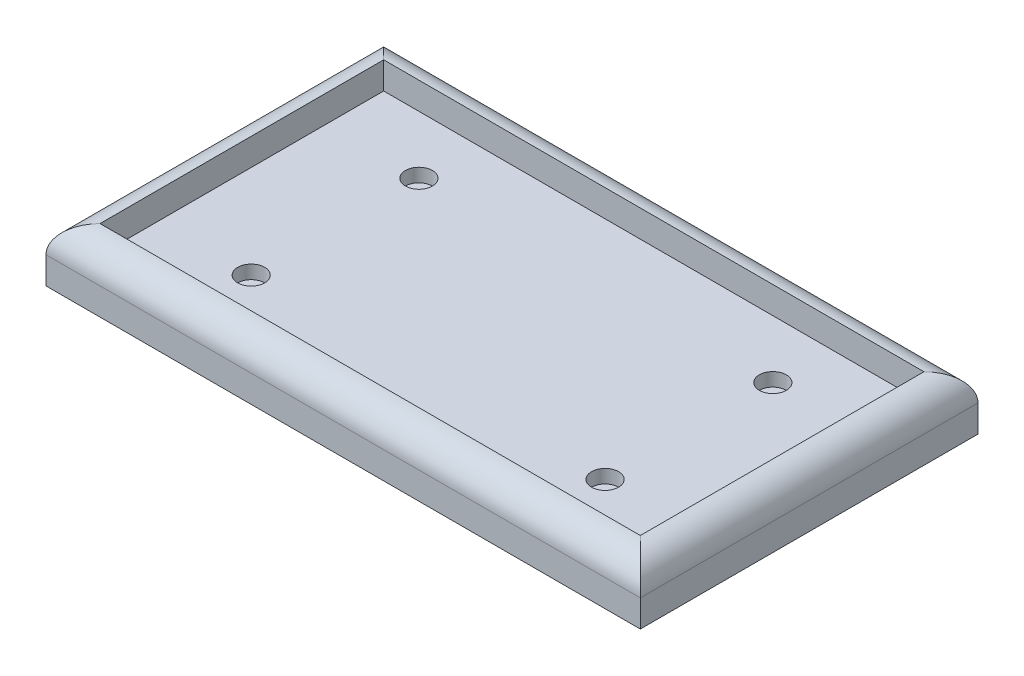
ISO-10303-21;
HEADER;
FILE_DESCRIPTION(('STEP AP214'),'2;1');
FILE_NAME('part.step','',(''),(''),'','','');
FILE_SCHEMA(('AUTOMOTIVE_DESIGN { 1 0 10303 214 1 1 1 1 }'));
ENDSEC;
DATA;
#1=APPLICATION_CONTEXT('core data for automotive mechanical design processes');
#2=APPLICATION_PROTOCOL_DEFINITION('international standard','automotive_design',2000,#1);
#3=PRODUCT_CONTEXT('',#1,'mechanical');
#4=PRODUCT('Part','Part','',(#3));
#5=PRODUCT_RELATED_PRODUCT_CATEGORY('part','',(#4));
#6=PRODUCT_DEFINITION_FORMATION('','',#4);
#7=PRODUCT_DEFINITION_CONTEXT('part definition',#1,'design');
#8=PRODUCT_DEFINITION('design','',#6,#7);
#9=PRODUCT_DEFINITION_SHAPE('','',#8);
#10=(LENGTH_UNIT() NAMED_UNIT(*) SI_UNIT(.MILLI.,.METRE.));
#11=(NAMED_UNIT(*) PLANE_ANGLE_UNIT() SI_UNIT($,.RADIAN.));
#12=(NAMED_UNIT(*) SI_UNIT($,.STERADIAN.) SOLID_ANGLE_UNIT());
#13=UNCERTAINTY_MEASURE_WITH_UNIT(LENGTH_MEASURE(1.E-05),#10,'distance_accuracy_value','');
#14=(GEOMETRIC_REPRESENTATION_CONTEXT(3) GLOBAL_UNCERTAINTY_ASSIGNED_CONTEXT((#13)) GLOBAL_UNIT_ASSIGNED_CONTEXT((#10,
#11,#12)) REPRESENTATION_CONTEXT('',''));
#15=CARTESIAN_POINT('',(0.,0.,0.));
#16=DIRECTION('',(0.,0.,1.));
#17=DIRECTION('',(1.,0.,0.));
#18=AXIS2_PLACEMENT_3D('',#15,#16,#17);
#19=CARTESIAN_POINT('',(-65.5,20.,31.045));
#20=DIRECTION('',(0.,-1.,0.));
#21=DIRECTION('',(0.,0.,-1.));
#22=AXIS2_PLACEMENT_3D('',#19,#20,#21);
#23=CYLINDRICAL_SURFACE('',#22,2.);
#24=CARTESIAN_POINT('',(-65.5,-5.,31.045));
#25=DIRECTION('',(0.,-1.,0.));
#26=DIRECTION('',(0.,0.,-1.));
#27=AXIS2_PLACEMENT_3D('',#24,#25,#26);
#28=CIRCLE('',#27,2.);
#29=CARTESIAN_POINT('',(-65.5,-5.,29.045));
#30=VERTEX_POINT('',#29);
#31=EDGE_CURVE('E243',#30,#30,#28,.T.);
#32=ORIENTED_EDGE('',*,*,#31,.T.);
#33=EDGE_LOOP('',(#32));
#34=FACE_BOUND('',#33,.T.);
#35=CARTESIAN_POINT('',(-65.5,5.,31.045));
#36=DIRECTION('',(0.,1.,0.));
#37=DIRECTION('',(0.,0.,1.));
#38=AXIS2_PLACEMENT_3D('',#35,#36,#37);
#39=CIRCLE('',#38,2.);
#40=CARTESIAN_POINT('',(-65.5,5.,33.045));
#41=VERTEX_POINT('',#40);
#42=EDGE_CURVE('E39',#41,#41,#39,.F.);
#43=ORIENTED_EDGE('',*,*,#42,.F.);
#44=EDGE_LOOP('',(#43));
#45=FACE_BOUND('',#44,.T.);
#46=ADVANCED_FACE('F35',(#34,#45),#23,.F.);
#47=CARTESIAN_POINT('',(-65.5,20.,-31.045));
#48=DIRECTION('',(0.,-1.,0.));
#49=DIRECTION('',(0.,0.,-1.));
#50=AXIS2_PLACEMENT_3D('',#47,#48,#49);
#51=CYLINDRICAL_SURFACE('',#50,2.);
#52=CARTESIAN_POINT('',(-65.5,-5.,-31.045));
#53=DIRECTION('',(0.,-1.,0.));
#54=DIRECTION('',(0.,0.,-1.));
#55=AXIS2_PLACEMENT_3D('',#52,#53,#54);
#56=CIRCLE('',#55,2.);
#57=CARTESIAN_POINT('',(-65.5,-5.,-33.045));
#58=VERTEX_POINT('',#57);
#59=EDGE_CURVE('E239',#58,#58,#56,.T.);
#60=ORIENTED_EDGE('',*,*,#59,.T.);
#61=EDGE_LOOP('',(#60));
#62=FACE_BOUND('',#61,.T.);
#63=CARTESIAN_POINT('',(-65.5,5.,-31.045));
#64=DIRECTION('',(0.,1.,0.));
#65=DIRECTION('',(0.,0.,1.));
#66=AXIS2_PLACEMENT_3D('',#63,#64,#65);
#67=CIRCLE('',#66,2.);
#68=CARTESIAN_POINT('',(-65.5,5.,-29.045));
#69=VERTEX_POINT('',#68);
#70=EDGE_CURVE('E225',#69,#69,#67,.F.);
#71=ORIENTED_EDGE('',*,*,#70,.F.);
#72=EDGE_LOOP('',(#71));
#73=FACE_BOUND('',#72,.T.);
#74=ADVANCED_FACE('F327',(#62,#73),#51,.F.);
#75=CARTESIAN_POINT('',(65.5,20.,-31.045));
#76=DIRECTION('',(0.,-1.,0.));
#77=DIRECTION('',(0.,0.,-1.));
#78=AXIS2_PLACEMENT_3D('',#75,#76,#77);
#79=CYLINDRICAL_SURFACE('',#78,2.);
#80=CARTESIAN_POINT('',(65.5,-5.,-31.045));
#81=DIRECTION('',(0.,-1.,0.));
#82=DIRECTION('',(0.,0.,-1.));
#83=AXIS2_PLACEMENT_3D('',#80,#81,#82);
#84=CIRCLE('',#83,2.);
#85=CARTESIAN_POINT('',(65.5,-5.,-33.045));
#86=VERTEX_POINT('',#85);
#87=EDGE_CURVE('E234',#86,#86,#84,.T.);
#88=ORIENTED_EDGE('',*,*,#87,.T.);
#89=EDGE_LOOP('',(#88));
#90=FACE_BOUND('',#89,.T.);
#91=CARTESIAN_POINT('',(65.5,5.,-31.045));
#92=DIRECTION('',(0.,1.,0.));
#93=DIRECTION('',(0.,0.,1.));
#94=AXIS2_PLACEMENT_3D('',#91,#92,#93);
#95=CIRCLE('',#94,2.);
#96=CARTESIAN_POINT('',(65.5,5.,-29.045));
#97=VERTEX_POINT('',#96);
#98=EDGE_CURVE('E222',#97,#97,#95,.F.);
#99=ORIENTED_EDGE('',*,*,#98,.F.);
#100=EDGE_LOOP('',(#99));
#101=FACE_BOUND('',#100,.T.);
#102=ADVANCED_FACE('F333',(#90,#101),#79,.F.);
#103=CARTESIAN_POINT('',(65.5,20.,31.045));
#104=DIRECTION('',(0.,-1.,0.));
#105=DIRECTION('',(0.,0.,-1.));
#106=AXIS2_PLACEMENT_3D('',#103,#104,#105);
#107=CYLINDRICAL_SURFACE('',#106,2.);
#108=CARTESIAN_POINT('',(65.5,-5.,31.045));
#109=DIRECTION('',(0.,-1.,0.));
#110=DIRECTION('',(0.,0.,-1.));
#111=AXIS2_PLACEMENT_3D('',#108,#109,#110);
#112=CIRCLE('',#111,2.);
#113=CARTESIAN_POINT('',(65.5,-5.,29.045));
#114=VERTEX_POINT('',#113);
#115=EDGE_CURVE('E230',#114,#114,#112,.T.);
#116=ORIENTED_EDGE('',*,*,#115,.T.);
#117=EDGE_LOOP('',(#116));
#118=FACE_BOUND('',#117,.T.);
#119=CARTESIAN_POINT('',(65.5,5.,31.045));
#120=DIRECTION('',(0.,1.,0.));
#121=DIRECTION('',(0.,0.,1.));
#122=AXIS2_PLACEMENT_3D('',#119,#120,#121);
#123=CIRCLE('',#122,2.);
#124=CARTESIAN_POINT('',(65.5,5.,33.045));
#125=VERTEX_POINT('',#124);
#126=EDGE_CURVE('E219',#125,#125,#123,.F.);
#127=ORIENTED_EDGE('',*,*,#126,.F.);
#128=EDGE_LOOP('',(#127));
#129=FACE_BOUND('',#128,.T.);
#130=ADVANCED_FACE('F339',(#118,#129),#107,.F.);
#131=CARTESIAN_POINT('',(-110.,20.,-62.5));
#132=DIRECTION('',(1.,0.,0.));
#133=DIRECTION('',(0.,0.,-1.));
#134=AXIS2_PLACEMENT_3D('',#131,#132,#133);
#135=PLANE('',#134);
#136=DIRECTION('',(0.,-1.,0.));
#137=VECTOR('',#136,1.);
#138=CARTESIAN_POINT('',(-110.,20.,62.5));
#139=LINE('',#138,#137);
#140=CARTESIAN_POINT('',(-110.,10.,62.5));
#141=VERTEX_POINT('',#140);
#142=CARTESIAN_POINT('',(-110.,0.,62.5));
#143=VERTEX_POINT('',#142);
#144=EDGE_CURVE('E205',#141,#143,#139,.T.);
#145=ORIENTED_EDGE('',*,*,#144,.F.);
#146=DIRECTION('',(0.,0.,1.));
#147=VECTOR('',#146,1.);
#148=CARTESIAN_POINT('',(-110.,10.,-62.5));
#149=LINE('',#148,#147);
#150=CARTESIAN_POINT('',(-110.,10.,-62.5));
#151=VERTEX_POINT('',#150);
#152=EDGE_CURVE('E11',#141,#151,#149,.F.);
#153=ORIENTED_EDGE('',*,*,#152,.T.);
#154=DIRECTION('',(0.,-1.,0.));
#155=VECTOR('',#154,1.);
#156=CARTESIAN_POINT('',(-110.,20.,-62.5));
#157=LINE('',#156,#155);
#158=CARTESIAN_POINT('',(-110.,0.,-62.5));
#159=VERTEX_POINT('',#158);
#160=EDGE_CURVE('E199',#151,#159,#157,.T.);
#161=ORIENTED_EDGE('',*,*,#160,.T.);
#162=DIRECTION('',(0.,0.,1.));
#163=VECTOR('',#162,1.);
#164=CARTESIAN_POINT('',(-110.,0.,-62.5));
#165=LINE('',#164,#163);
#166=EDGE_CURVE('E180',#159,#143,#165,.T.);
#167=ORIENTED_EDGE('',*,*,#166,.T.);
#168=EDGE_LOOP('',(#145,#153,#161,#167));
#169=FACE_BOUND('',#168,.T.);
#170=ADVANCED_FACE('F273',(#169),#135,.F.);
#171=CARTESIAN_POINT('',(110.,20.,62.5));
#172=DIRECTION('',(0.,0.,-1.));
#173=DIRECTION('',(-1.,0.,0.));
#174=AXIS2_PLACEMENT_3D('',#171,#172,#173);
#175=PLANE('',#174);
#176=DIRECTION('',(0.,-1.,0.));
#177=VECTOR('',#176,1.);
#178=CARTESIAN_POINT('',(110.,20.,62.5));
#179=LINE('',#178,#177);
#180=CARTESIAN_POINT('',(110.,10.,62.5));
#181=VERTEX_POINT('',#180);
#182=CARTESIAN_POINT('',(110.,0.,62.5));
#183=VERTEX_POINT('',#182);
#184=EDGE_CURVE('E203',#181,#183,#179,.T.);
#185=ORIENTED_EDGE('',*,*,#184,.F.);
#186=DIRECTION('',(1.,0.,0.));
#187=VECTOR('',#186,1.);
#188=CARTESIAN_POINT('',(110.,10.,62.5));
#189=LINE('',#188,#187);
#190=EDGE_CURVE('E210',#181,#141,#189,.F.);
#191=ORIENTED_EDGE('',*,*,#190,.T.);
#192=ORIENTED_EDGE('',*,*,#144,.T.);
#193=DIRECTION('',(1.,0.,0.));
#194=VECTOR('',#193,1.);
#195=CARTESIAN_POINT('',(110.,0.,62.5));
#196=LINE('',#195,#194);
#197=EDGE_CURVE('E190',#143,#183,#196,.T.);
#198=ORIENTED_EDGE('',*,*,#197,.T.);
#199=EDGE_LOOP('',(#185,#191,#192,#198));
#200=FACE_BOUND('',#199,.T.);
#201=ADVANCED_FACE('F285',(#200),#175,.F.);
#202=CARTESIAN_POINT('',(110.,20.,-62.5));
#203=DIRECTION('',(-1.,0.,0.));
#204=DIRECTION('',(0.,0.,1.));
#205=AXIS2_PLACEMENT_3D('',#202,#203,#204);
#206=PLANE('',#205);
#207=DIRECTION('',(0.,-1.,0.));
#208=VECTOR('',#207,1.);
#209=CARTESIAN_POINT('',(110.,20.,-62.5));
#210=LINE('',#209,#208);
#211=CARTESIAN_POINT('',(110.,10.,-62.5));
#212=VERTEX_POINT('',#211);
#213=CARTESIAN_POINT('',(110.,0.,-62.5));
#214=VERTEX_POINT('',#213);
#215=EDGE_CURVE('E201',#212,#214,#210,.T.);
#216=ORIENTED_EDGE('',*,*,#215,.F.);
#217=DIRECTION('',(0.,0.,-1.));
#218=VECTOR('',#217,1.);
#219=CARTESIAN_POINT('',(110.,10.,-62.5));
#220=LINE('',#219,#218);
#221=EDGE_CURVE('E207',#212,#181,#220,.F.);
#222=ORIENTED_EDGE('',*,*,#221,.T.);
#223=ORIENTED_EDGE('',*,*,#184,.T.);
#224=DIRECTION('',(0.,0.,-1.));
#225=VECTOR('',#224,1.);
#226=CARTESIAN_POINT('',(110.,0.,-62.5));
#227=LINE('',#226,#225);
#228=EDGE_CURVE('E193',#183,#214,#227,.T.);
#229=ORIENTED_EDGE('',*,*,#228,.T.);
#230=EDGE_LOOP('',(#216,#222,#223,#229));
#231=FACE_BOUND('',#230,.T.);
#232=ADVANCED_FACE('F282',(#231),#206,.F.);
#233=CARTESIAN_POINT('',(110.,20.,-62.5));
#234=DIRECTION('',(0.,0.,1.));
#235=DIRECTION('',(1.,0.,0.));
#236=AXIS2_PLACEMENT_3D('',#233,#234,#235);
#237=PLANE('',#236);
#238=ORIENTED_EDGE('',*,*,#160,.F.);
#239=DIRECTION('',(-1.,0.,0.));
#240=VECTOR('',#239,1.);
#241=CARTESIAN_POINT('',(110.,10.,-62.5));
#242=LINE('',#241,#240);
#243=EDGE_CURVE('E44',#151,#212,#242,.F.);
#244=ORIENTED_EDGE('',*,*,#243,.T.);
#245=ORIENTED_EDGE('',*,*,#215,.T.);
#246=DIRECTION('',(-1.,0.,0.));
#247=VECTOR('',#246,1.);
#248=CARTESIAN_POINT('',(110.,0.,-62.5));
#249=LINE('',#248,#247);
#250=EDGE_CURVE('E196',#214,#159,#249,.T.);
#251=ORIENTED_EDGE('',*,*,#250,.T.);
#252=EDGE_LOOP('',(#238,#244,#245,#251));
#253=FACE_BOUND('',#252,.T.);
#254=ADVANCED_FACE('F265',(#253),#237,.F.);
#255=CARTESIAN_POINT('',(0.,0.,0.));
#256=DIRECTION('',(0.,-1.,0.));
#257=DIRECTION('',(0.,0.,-1.));
#258=AXIS2_PLACEMENT_3D('',#255,#256,#257);
#259=PLANE('',#258);
#260=DIRECTION('',(0.,0.,-1.));
#261=VECTOR('',#260,1.);
#262=CARTESIAN_POINT('',(-85.5,0.,51.045));
#263=LINE('',#262,#261);
#264=CARTESIAN_POINT('',(-85.5,0.,51.045));
#265=VERTEX_POINT('',#264);
#266=CARTESIAN_POINT('',(-85.5,0.,-51.045));
#267=VERTEX_POINT('',#266);
#268=EDGE_CURVE('E52',#265,#267,#263,.T.);
#269=ORIENTED_EDGE('',*,*,#268,.F.);
#270=DIRECTION('',(-1.,0.,0.));
#271=VECTOR('',#270,1.);
#272=CARTESIAN_POINT('',(85.5,0.,51.045));
#273=LINE('',#272,#271);
#274=CARTESIAN_POINT('',(85.5,0.,51.045));
#275=VERTEX_POINT('',#274);
#276=EDGE_CURVE('E56',#275,#265,#273,.T.);
#277=ORIENTED_EDGE('',*,*,#276,.F.);
#278=DIRECTION('',(0.,0.,1.));
#279=VECTOR('',#278,1.);
#280=CARTESIAN_POINT('',(85.5,0.,51.045));
#281=LINE('',#280,#279);
#282=CARTESIAN_POINT('',(85.5,0.,-51.045));
#283=VERTEX_POINT('',#282);
#284=EDGE_CURVE('E252',#283,#275,#281,.T.);
#285=ORIENTED_EDGE('',*,*,#284,.F.);
#286=DIRECTION('',(1.,0.,0.));
#287=VECTOR('',#286,1.);
#288=CARTESIAN_POINT('',(85.5,0.,-51.045));
#289=LINE('',#288,#287);
#290=EDGE_CURVE('E250',#267,#283,#289,.T.);
#291=ORIENTED_EDGE('',*,*,#290,.F.);
#292=EDGE_LOOP('',(#269,#277,#285,#291));
#293=FACE_BOUND('',#292,.T.);
#294=ORIENTED_EDGE('',*,*,#166,.F.);
#295=ORIENTED_EDGE('',*,*,#250,.F.);
#296=ORIENTED_EDGE('',*,*,#228,.F.);
#297=ORIENTED_EDGE('',*,*,#197,.F.);
#298=EDGE_LOOP('',(#294,#295,#296,#297));
#299=FACE_BOUND('',#298,.T.);
#300=ADVANCED_FACE('F261',(#293,#299),#259,.T.);
#301=CARTESIAN_POINT('',(-100.,10.,-52.5));
#302=DIRECTION('',(-1.,0.,0.));
#303=DIRECTION('',(0.,0.,1.));
#304=AXIS2_PLACEMENT_3D('',#301,#302,#303);
#305=PLANE('',#304);
#306=DIRECTION('',(0.,0.,1.));
#307=VECTOR('',#306,1.);
#308=CARTESIAN_POINT('',(-100.,20.,-52.5));
#309=LINE('',#308,#307);
#310=CARTESIAN_POINT('',(-100.,20.,-52.5));
#311=VERTEX_POINT('',#310);
#312=CARTESIAN_POINT('',(-100.,20.,52.5));
#313=VERTEX_POINT('',#312);
#314=EDGE_CURVE('E167',#311,#313,#309,.T.);
#315=ORIENTED_EDGE('',*,*,#314,.T.);
#316=DIRECTION('',(0.,1.,0.));
#317=VECTOR('',#316,1.);
#318=CARTESIAN_POINT('',(-100.,10.,52.5));
#319=LINE('',#318,#317);
#320=CARTESIAN_POINT('',(-100.,10.,52.5));
#321=VERTEX_POINT('',#320);
#322=EDGE_CURVE('E166',#321,#313,#319,.T.);
#323=ORIENTED_EDGE('',*,*,#322,.F.);
#324=DIRECTION('',(0.,0.,1.));
#325=VECTOR('',#324,1.);
#326=CARTESIAN_POINT('',(-100.,10.,-52.5));
#327=LINE('',#326,#325);
#328=CARTESIAN_POINT('',(-100.,10.,-52.5));
#329=VERTEX_POINT('',#328);
#330=EDGE_CURVE('E153',#329,#321,#327,.T.);
#331=ORIENTED_EDGE('',*,*,#330,.F.);
#332=DIRECTION('',(0.,1.,0.));
#333=VECTOR('',#332,1.);
#334=CARTESIAN_POINT('',(-100.,10.,-52.5));
#335=LINE('',#334,#333);
#336=EDGE_CURVE('E178',#329,#311,#335,.T.);
#337=ORIENTED_EDGE('',*,*,#336,.T.);
#338=EDGE_LOOP('',(#315,#323,#331,#337));
#339=FACE_BOUND('',#338,.T.);
#340=ADVANCED_FACE('F264',(#339),#305,.F.);
#341=CARTESIAN_POINT('',(100.,10.,-52.5));
#342=DIRECTION('',(0.,0.,-1.));
#343=DIRECTION('',(-1.,0.,0.));
#344=AXIS2_PLACEMENT_3D('',#341,#342,#343);
#345=PLANE('',#344);
#346=DIRECTION('',(-1.,0.,0.));
#347=VECTOR('',#346,1.);
#348=CARTESIAN_POINT('',(100.,20.,-52.5));
#349=LINE('',#348,#347);
#350=CARTESIAN_POINT('',(100.,20.,-52.5));
#351=VERTEX_POINT('',#350);
#352=EDGE_CURVE('E157',#351,#311,#349,.T.);
#353=ORIENTED_EDGE('',*,*,#352,.T.);
#354=ORIENTED_EDGE('',*,*,#336,.F.);
#355=DIRECTION('',(-1.,0.,0.));
#356=VECTOR('',#355,1.);
#357=CARTESIAN_POINT('',(100.,10.,-52.5));
#358=LINE('',#357,#356);
#359=CARTESIAN_POINT('',(100.,10.,-52.5));
#360=VERTEX_POINT('',#359);
#361=EDGE_CURVE('E163',#360,#329,#358,.T.);
#362=ORIENTED_EDGE('',*,*,#361,.F.);
#363=DIRECTION('',(0.,1.,0.));
#364=VECTOR('',#363,1.);
#365=CARTESIAN_POINT('',(100.,10.,-52.5));
#366=LINE('',#365,#364);
#367=EDGE_CURVE('E181',#360,#351,#366,.T.);
#368=ORIENTED_EDGE('',*,*,#367,.T.);
#369=EDGE_LOOP('',(#353,#354,#362,#368));
#370=FACE_BOUND('',#369,.T.);
#371=ADVANCED_FACE('F311',(#370),#345,.F.);
#372=CARTESIAN_POINT('',(100.,10.,-52.5));
#373=DIRECTION('',(1.,0.,0.));
#374=DIRECTION('',(0.,0.,-1.));
#375=AXIS2_PLACEMENT_3D('',#372,#373,#374);
#376=PLANE('',#375);
#377=DIRECTION('',(0.,0.,-1.));
#378=VECTOR('',#377,1.);
#379=CARTESIAN_POINT('',(100.,20.,-52.5));
#380=LINE('',#379,#378);
#381=CARTESIAN_POINT('',(100.,20.,52.5));
#382=VERTEX_POINT('',#381);
#383=EDGE_CURVE('E173',#382,#351,#380,.T.);
#384=ORIENTED_EDGE('',*,*,#383,.T.);
#385=ORIENTED_EDGE('',*,*,#367,.F.);
#386=DIRECTION('',(0.,0.,-1.));
#387=VECTOR('',#386,1.);
#388=CARTESIAN_POINT('',(100.,10.,-52.5));
#389=LINE('',#388,#387);
#390=CARTESIAN_POINT('',(100.,10.,52.5));
#391=VERTEX_POINT('',#390);
#392=EDGE_CURVE('E160',#391,#360,#389,.T.);
#393=ORIENTED_EDGE('',*,*,#392,.F.);
#394=DIRECTION('',(0.,1.,0.));
#395=VECTOR('',#394,1.);
#396=CARTESIAN_POINT('',(100.,10.,52.5));
#397=LINE('',#396,#395);
#398=EDGE_CURVE('E184',#391,#382,#397,.T.);
#399=ORIENTED_EDGE('',*,*,#398,.T.);
#400=EDGE_LOOP('',(#384,#385,#393,#399));
#401=FACE_BOUND('',#400,.T.);
#402=ADVANCED_FACE('F302',(#401),#376,.F.);
#403=CARTESIAN_POINT('',(100.,10.,52.5));
#404=DIRECTION('',(0.,0.,1.));
#405=DIRECTION('',(1.,0.,0.));
#406=AXIS2_PLACEMENT_3D('',#403,#404,#405);
#407=PLANE('',#406);
#408=DIRECTION('',(1.,0.,0.));
#409=VECTOR('',#408,1.);
#410=CARTESIAN_POINT('',(100.,20.,52.5));
#411=LINE('',#410,#409);
#412=EDGE_CURVE('E169',#313,#382,#411,.T.);
#413=ORIENTED_EDGE('',*,*,#412,.T.);
#414=ORIENTED_EDGE('',*,*,#398,.F.);
#415=DIRECTION('',(1.,0.,0.));
#416=VECTOR('',#415,1.);
#417=CARTESIAN_POINT('',(100.,10.,52.5));
#418=LINE('',#417,#416);
#419=EDGE_CURVE('E156',#321,#391,#418,.T.);
#420=ORIENTED_EDGE('',*,*,#419,.F.);
#421=ORIENTED_EDGE('',*,*,#322,.T.);
#422=EDGE_LOOP('',(#413,#414,#420,#421));
#423=FACE_BOUND('',#422,.T.);
#424=ADVANCED_FACE('F306',(#423),#407,.F.);
#425=CARTESIAN_POINT('',(0.,10.,0.));
#426=DIRECTION('',(0.,-1.,0.));
#427=DIRECTION('',(0.,0.,-1.));
#428=AXIS2_PLACEMENT_3D('',#425,#426,#427);
#429=PLANE('',#428);
#430=CARTESIAN_POINT('',(65.5,10.,-31.045));
#431=DIRECTION('',(0.,1.,0.));
#432=DIRECTION('',(0.,0.,1.));
#433=AXIS2_PLACEMENT_3D('',#430,#431,#432);
#434=CIRCLE('',#433,5.00000000000001);
#435=CARTESIAN_POINT('',(65.5,10.,-26.045));
#436=VERTEX_POINT('',#435);
#437=EDGE_CURVE('E548',#436,#436,#434,.T.);
#438=ORIENTED_EDGE('',*,*,#437,.F.);
#439=EDGE_LOOP('',(#438));
#440=FACE_BOUND('',#439,.T.);
#441=CARTESIAN_POINT('',(65.5,10.,31.045));
#442=DIRECTION('',(0.,1.,0.));
#443=DIRECTION('',(0.,0.,1.));
#444=AXIS2_PLACEMENT_3D('',#441,#442,#443);
#445=CIRCLE('',#444,5.);
#446=CARTESIAN_POINT('',(65.5,10.,36.045));
#447=VERTEX_POINT('',#446);
#448=EDGE_CURVE('E540',#447,#447,#445,.T.);
#449=ORIENTED_EDGE('',*,*,#448,.F.);
#450=EDGE_LOOP('',(#449));
#451=FACE_BOUND('',#450,.T.);
#452=CARTESIAN_POINT('',(-65.5,10.,31.045));
#453=DIRECTION('',(0.,1.,0.));
#454=DIRECTION('',(0.,0.,1.));
#455=AXIS2_PLACEMENT_3D('',#452,#453,#454);
#456=CIRCLE('',#455,5.);
#457=CARTESIAN_POINT('',(-65.5,10.,36.045));
#458=VERTEX_POINT('',#457);
#459=EDGE_CURVE('E533',#458,#458,#456,.T.);
#460=ORIENTED_EDGE('',*,*,#459,.F.);
#461=EDGE_LOOP('',(#460));
#462=FACE_BOUND('',#461,.T.);
#463=CARTESIAN_POINT('',(-65.5,10.,-31.045));
#464=DIRECTION('',(0.,1.,0.));
#465=DIRECTION('',(0.,0.,1.));
#466=AXIS2_PLACEMENT_3D('',#463,#464,#465);
#467=CIRCLE('',#466,5.);
#468=CARTESIAN_POINT('',(-65.5,10.,-26.045));
#469=VERTEX_POINT('',#468);
#470=EDGE_CURVE('E537',#469,#469,#467,.T.);
#471=ORIENTED_EDGE('',*,*,#470,.F.);
#472=EDGE_LOOP('',(#471));
#473=FACE_BOUND('',#472,.T.);
#474=ORIENTED_EDGE('',*,*,#330,.T.);
#475=ORIENTED_EDGE('',*,*,#419,.T.);
#476=ORIENTED_EDGE('',*,*,#392,.T.);
#477=ORIENTED_EDGE('',*,*,#361,.T.);
#478=EDGE_LOOP('',(#474,#475,#476,#477));
#479=FACE_BOUND('',#478,.T.);
#480=ADVANCED_FACE('F313',(#440,#451,#462,#473,#479),#429,.F.);
#481=CARTESIAN_POINT('',(-100.,10.,0.));
#482=DIRECTION('',(0.,0.,1.));
#483=DIRECTION('',(1.,0.,0.));
#484=AXIS2_PLACEMENT_3D('',#481,#482,#483);
#485=CYLINDRICAL_SURFACE('',#484,10.);
#486=CARTESIAN_POINT('',(-100.,10.,-52.5));
#487=DIRECTION('',(-0.707106781186547,0.,0.707106781186548));
#488=DIRECTION('',(0.707106781186548,0.,0.707106781186547));
#489=AXIS2_PLACEMENT_3D('',#486,#487,#488);
#490=ELLIPSE('',#489,14.1421356237309,10.);
#491=EDGE_CURVE('E214',#151,#311,#490,.F.);
#492=ORIENTED_EDGE('',*,*,#491,.F.);
#493=ORIENTED_EDGE('',*,*,#152,.F.);
#494=CARTESIAN_POINT('',(-100.,10.,52.5));
#495=DIRECTION('',(0.707106781186548,0.,0.707106781186547));
#496=DIRECTION('',(-0.707106781186547,0.,0.707106781186548));
#497=AXIS2_PLACEMENT_3D('',#494,#495,#496);
#498=ELLIPSE('',#497,14.1421356237309,10.);
#499=EDGE_CURVE('E170',#313,#141,#498,.T.);
#500=ORIENTED_EDGE('',*,*,#499,.F.);
#501=ORIENTED_EDGE('',*,*,#314,.F.);
#502=EDGE_LOOP('',(#492,#493,#500,#501));
#503=FACE_BOUND('',#502,.T.);
#504=ADVANCED_FACE('F37',(#503),#485,.T.);
#505=CARTESIAN_POINT('',(0.,10.,52.5));
#506=DIRECTION('',(1.,0.,0.));
#507=DIRECTION('',(0.,0.,-1.));
#508=AXIS2_PLACEMENT_3D('',#505,#506,#507);
#509=CYLINDRICAL_SURFACE('',#508,10.);
#510=ORIENTED_EDGE('',*,*,#499,.T.);
#511=ORIENTED_EDGE('',*,*,#190,.F.);
#512=CARTESIAN_POINT('',(100.,10.,52.5));
#513=DIRECTION('',(0.707106781186547,0.,-0.707106781186548));
#514=DIRECTION('',(0.707106781186548,0.,0.707106781186547));
#515=AXIS2_PLACEMENT_3D('',#512,#513,#514);
#516=ELLIPSE('',#515,14.1421356237309,10.);
#517=EDGE_CURVE('E147',#382,#181,#516,.T.);
#518=ORIENTED_EDGE('',*,*,#517,.F.);
#519=ORIENTED_EDGE('',*,*,#412,.F.);
#520=EDGE_LOOP('',(#510,#511,#518,#519));
#521=FACE_BOUND('',#520,.T.);
#522=ADVANCED_FACE('F289',(#521),#509,.T.);
#523=CARTESIAN_POINT('',(0.,10.,-52.5));
#524=DIRECTION('',(-1.,0.,0.));
#525=DIRECTION('',(0.,0.,1.));
#526=AXIS2_PLACEMENT_3D('',#523,#524,#525);
#527=CYLINDRICAL_SURFACE('',#526,10.);
#528=ORIENTED_EDGE('',*,*,#491,.T.);
#529=ORIENTED_EDGE('',*,*,#352,.F.);
#530=CARTESIAN_POINT('',(100.,10.,-52.5));
#531=DIRECTION('',(-0.707106781186548,0.,-0.707106781186547));
#532=DIRECTION('',(-0.707106781186547,0.,0.707106781186548));
#533=AXIS2_PLACEMENT_3D('',#530,#531,#532);
#534=ELLIPSE('',#533,14.142135623731,10.);
#535=EDGE_CURVE('E145',#212,#351,#534,.F.);
#536=ORIENTED_EDGE('',*,*,#535,.F.);
#537=ORIENTED_EDGE('',*,*,#243,.F.);
#538=EDGE_LOOP('',(#528,#529,#536,#537));
#539=FACE_BOUND('',#538,.T.);
#540=ADVANCED_FACE('F298',(#539),#527,.T.);
#541=CARTESIAN_POINT('',(100.,10.,0.));
#542=DIRECTION('',(0.,0.,-1.));
#543=DIRECTION('',(-1.,0.,0.));
#544=AXIS2_PLACEMENT_3D('',#541,#542,#543);
#545=CYLINDRICAL_SURFACE('',#544,10.);
#546=ORIENTED_EDGE('',*,*,#517,.T.);
#547=ORIENTED_EDGE('',*,*,#221,.F.);
#548=ORIENTED_EDGE('',*,*,#535,.T.);
#549=ORIENTED_EDGE('',*,*,#383,.F.);
#550=EDGE_LOOP('',(#546,#547,#548,#549));
#551=FACE_BOUND('',#550,.T.);
#552=ADVANCED_FACE('F300',(#551),#545,.T.);
#553=CARTESIAN_POINT('',(-85.5,-5.,51.045));
#554=DIRECTION('',(1.,0.,0.));
#555=DIRECTION('',(0.,0.,-1.));
#556=AXIS2_PLACEMENT_3D('',#553,#554,#555);
#557=PLANE('',#556);
#558=ORIENTED_EDGE('',*,*,#268,.T.);
#559=DIRECTION('',(0.,1.,0.));
#560=VECTOR('',#559,1.);
#561=CARTESIAN_POINT('',(-85.5,-5.,-51.045));
#562=LINE('',#561,#560);
#563=CARTESIAN_POINT('',(-85.5,-5.,-51.045));
#564=VERTEX_POINT('',#563);
#565=EDGE_CURVE('E128',#564,#267,#562,.T.);
#566=ORIENTED_EDGE('',*,*,#565,.F.);
#567=DIRECTION('',(0.,0.,-1.));
#568=VECTOR('',#567,1.);
#569=CARTESIAN_POINT('',(-85.5,-5.,51.045));
#570=LINE('',#569,#568);
#571=CARTESIAN_POINT('',(-85.5,-5.,51.045));
#572=VERTEX_POINT('',#571);
#573=EDGE_CURVE('E134',#572,#564,#570,.T.);
#574=ORIENTED_EDGE('',*,*,#573,.F.);
#575=DIRECTION('',(0.,1.,0.));
#576=VECTOR('',#575,1.);
#577=CARTESIAN_POINT('',(-85.5,-5.,51.045));
#578=LINE('',#577,#576);
#579=EDGE_CURVE('E248',#572,#265,#578,.T.);
#580=ORIENTED_EDGE('',*,*,#579,.T.);
#581=EDGE_LOOP('',(#558,#566,#574,#580));
#582=FACE_BOUND('',#581,.T.);
#583=ADVANCED_FACE('F144',(#582),#557,.F.);
#584=CARTESIAN_POINT('',(85.5,-5.,-51.045));
#585=DIRECTION('',(0.,0.,1.));
#586=DIRECTION('',(1.,0.,0.));
#587=AXIS2_PLACEMENT_3D('',#584,#585,#586);
#588=PLANE('',#587);
#589=ORIENTED_EDGE('',*,*,#290,.T.);
#590=DIRECTION('',(0.,1.,0.));
#591=VECTOR('',#590,1.);
#592=CARTESIAN_POINT('',(85.5,-5.,-51.045));
#593=LINE('',#592,#591);
#594=CARTESIAN_POINT('',(85.5,-5.,-51.045));
#595=VERTEX_POINT('',#594);
#596=EDGE_CURVE('E130',#595,#283,#593,.T.);
#597=ORIENTED_EDGE('',*,*,#596,.F.);
#598=DIRECTION('',(1.,0.,0.));
#599=VECTOR('',#598,1.);
#600=CARTESIAN_POINT('',(85.5,-5.,-51.045));
#601=LINE('',#600,#599);
#602=EDGE_CURVE('E123',#564,#595,#601,.T.);
#603=ORIENTED_EDGE('',*,*,#602,.F.);
#604=ORIENTED_EDGE('',*,*,#565,.T.);
#605=EDGE_LOOP('',(#589,#597,#603,#604));
#606=FACE_BOUND('',#605,.T.);
#607=ADVANCED_FACE('F126',(#606),#588,.F.);
#608=CARTESIAN_POINT('',(85.5,-5.,51.045));
#609=DIRECTION('',(-1.,0.,0.));
#610=DIRECTION('',(0.,0.,1.));
#611=AXIS2_PLACEMENT_3D('',#608,#609,#610);
#612=PLANE('',#611);
#613=ORIENTED_EDGE('',*,*,#284,.T.);
#614=DIRECTION('',(0.,1.,0.));
#615=VECTOR('',#614,1.);
#616=CARTESIAN_POINT('',(85.5,-5.,51.045));
#617=LINE('',#616,#615);
#618=CARTESIAN_POINT('',(85.5,-5.,51.045));
#619=VERTEX_POINT('',#618);
#620=EDGE_CURVE('E149',#619,#275,#617,.T.);
#621=ORIENTED_EDGE('',*,*,#620,.F.);
#622=DIRECTION('',(0.,0.,1.));
#623=VECTOR('',#622,1.);
#624=CARTESIAN_POINT('',(85.5,-5.,51.045));
#625=LINE('',#624,#623);
#626=EDGE_CURVE('E133',#595,#619,#625,.T.);
#627=ORIENTED_EDGE('',*,*,#626,.F.);
#628=ORIENTED_EDGE('',*,*,#596,.T.);
#629=EDGE_LOOP('',(#613,#621,#627,#628));
#630=FACE_BOUND('',#629,.T.);
#631=ADVANCED_FACE('F260',(#630),#612,.F.);
#632=CARTESIAN_POINT('',(85.5,-5.,51.045));
#633=DIRECTION('',(0.,0.,-1.));
#634=DIRECTION('',(-1.,0.,0.));
#635=AXIS2_PLACEMENT_3D('',#632,#633,#634);
#636=PLANE('',#635);
#637=ORIENTED_EDGE('',*,*,#276,.T.);
#638=ORIENTED_EDGE('',*,*,#579,.F.);
#639=DIRECTION('',(-1.,0.,0.));
#640=VECTOR('',#639,1.);
#641=CARTESIAN_POINT('',(85.5,-5.,51.045));
#642=LINE('',#641,#640);
#643=EDGE_CURVE('E139',#619,#572,#642,.T.);
#644=ORIENTED_EDGE('',*,*,#643,.F.);
#645=ORIENTED_EDGE('',*,*,#620,.T.);
#646=EDGE_LOOP('',(#637,#638,#644,#645));
#647=FACE_BOUND('',#646,.T.);
#648=ADVANCED_FACE('F258',(#647),#636,.F.);
#649=CARTESIAN_POINT('',(0.,-5.,0.));
#650=DIRECTION('',(0.,1.,0.));
#651=DIRECTION('',(0.,0.,1.));
#652=AXIS2_PLACEMENT_3D('',#649,#650,#651);
#653=PLANE('',#652);
#654=ORIENTED_EDGE('',*,*,#115,.F.);
#655=EDGE_LOOP('',(#654));
#656=FACE_BOUND('',#655,.T.);
#657=ORIENTED_EDGE('',*,*,#87,.F.);
#658=EDGE_LOOP('',(#657));
#659=FACE_BOUND('',#658,.T.);
#660=ORIENTED_EDGE('',*,*,#59,.F.);
#661=EDGE_LOOP('',(#660));
#662=FACE_BOUND('',#661,.T.);
#663=ORIENTED_EDGE('',*,*,#31,.F.);
#664=EDGE_LOOP('',(#663));
#665=FACE_BOUND('',#664,.T.);
#666=ORIENTED_EDGE('',*,*,#573,.T.);
#667=ORIENTED_EDGE('',*,*,#602,.T.);
#668=ORIENTED_EDGE('',*,*,#626,.T.);
#669=ORIENTED_EDGE('',*,*,#643,.T.);
#670=EDGE_LOOP('',(#666,#667,#668,#669));
#671=FACE_BOUND('',#670,.T.);
#672=ADVANCED_FACE('F137',(#656,#659,#662,#665,#671),#653,.F.);
#673=CARTESIAN_POINT('',(65.5,5.,31.045));
#674=DIRECTION('',(0.,1.,0.));
#675=DIRECTION('',(0.,0.,1.));
#676=AXIS2_PLACEMENT_3D('',#673,#674,#675);
#677=PLANE('',#676);
#678=CARTESIAN_POINT('',(65.5,5.,31.045));
#679=DIRECTION('',(0.,1.,0.));
#680=DIRECTION('',(0.,0.,1.));
#681=AXIS2_PLACEMENT_3D('',#678,#679,#680);
#682=CIRCLE('',#681,5.);
#683=CARTESIAN_POINT('',(65.5,5.,36.045));
#684=VERTEX_POINT('',#683);
#685=EDGE_CURVE('E535',#684,#684,#682,.T.);
#686=ORIENTED_EDGE('',*,*,#685,.T.);
#687=EDGE_LOOP('',(#686));
#688=FACE_BOUND('',#687,.T.);
#689=ORIENTED_EDGE('',*,*,#126,.T.);
#690=EDGE_LOOP('',(#689));
#691=FACE_BOUND('',#690,.T.);
#692=ADVANCED_FACE('F343',(#688,#691),#677,.T.);
#693=CARTESIAN_POINT('',(65.5,5.,31.045));
#694=DIRECTION('',(0.,1.,0.));
#695=DIRECTION('',(0.,0.,1.));
#696=AXIS2_PLACEMENT_3D('',#693,#694,#695);
#697=CYLINDRICAL_SURFACE('',#696,5.);
#698=ORIENTED_EDGE('',*,*,#685,.F.);
#699=EDGE_LOOP('',(#698));
#700=FACE_BOUND('',#699,.T.);
#701=ORIENTED_EDGE('',*,*,#448,.T.);
#702=EDGE_LOOP('',(#701));
#703=FACE_BOUND('',#702,.T.);
#704=ADVANCED_FACE('F453',(#700,#703),#697,.F.);
#705=CARTESIAN_POINT('',(65.5,5.,-31.045));
#706=DIRECTION('',(0.,1.,0.));
#707=DIRECTION('',(0.,0.,1.));
#708=AXIS2_PLACEMENT_3D('',#705,#706,#707);
#709=PLANE('',#708);
#710=CARTESIAN_POINT('',(65.5,5.,-31.045));
#711=DIRECTION('',(0.,1.,0.));
#712=DIRECTION('',(0.,0.,1.));
#713=AXIS2_PLACEMENT_3D('',#710,#711,#712);
#714=CIRCLE('',#713,5.00000000000001);
#715=CARTESIAN_POINT('',(65.5,5.,-26.045));
#716=VERTEX_POINT('',#715);
#717=EDGE_CURVE('E545',#716,#716,#714,.T.);
#718=ORIENTED_EDGE('',*,*,#717,.T.);
#719=EDGE_LOOP('',(#718));
#720=FACE_BOUND('',#719,.T.);
#721=ORIENTED_EDGE('',*,*,#98,.T.);
#722=EDGE_LOOP('',(#721));
#723=FACE_BOUND('',#722,.T.);
#724=ADVANCED_FACE('F463',(#720,#723),#709,.T.);
#725=CARTESIAN_POINT('',(65.5,5.,-31.045));
#726=DIRECTION('',(0.,1.,0.));
#727=DIRECTION('',(0.,0.,1.));
#728=AXIS2_PLACEMENT_3D('',#725,#726,#727);
#729=CYLINDRICAL_SURFACE('',#728,5.00000000000001);
#730=ORIENTED_EDGE('',*,*,#717,.F.);
#731=EDGE_LOOP('',(#730));
#732=FACE_BOUND('',#731,.T.);
#733=ORIENTED_EDGE('',*,*,#437,.T.);
#734=EDGE_LOOP('',(#733));
#735=FACE_BOUND('',#734,.T.);
#736=ADVANCED_FACE('F473',(#732,#735),#729,.F.);
#737=CARTESIAN_POINT('',(-65.5,5.,-31.045));
#738=DIRECTION('',(0.,1.,0.));
#739=DIRECTION('',(0.,0.,1.));
#740=AXIS2_PLACEMENT_3D('',#737,#738,#739);
#741=PLANE('',#740);
#742=CARTESIAN_POINT('',(-65.5,5.,-31.045));
#743=DIRECTION('',(0.,1.,0.));
#744=DIRECTION('',(0.,0.,1.));
#745=AXIS2_PLACEMENT_3D('',#742,#743,#744);
#746=CIRCLE('',#745,5.);
#747=CARTESIAN_POINT('',(-65.5,5.,-26.045));
#748=VERTEX_POINT('',#747);
#749=EDGE_CURVE('E223',#748,#748,#746,.T.);
#750=ORIENTED_EDGE('',*,*,#749,.T.);
#751=EDGE_LOOP('',(#750));
#752=FACE_BOUND('',#751,.T.);
#753=ORIENTED_EDGE('',*,*,#70,.T.);
#754=EDGE_LOOP('',(#753));
#755=FACE_BOUND('',#754,.T.);
#756=ADVANCED_FACE('F483',(#752,#755),#741,.T.);
#757=CARTESIAN_POINT('',(-65.5,5.,-31.045));
#758=DIRECTION('',(0.,1.,0.));
#759=DIRECTION('',(0.,0.,1.));
#760=AXIS2_PLACEMENT_3D('',#757,#758,#759);
#761=CYLINDRICAL_SURFACE('',#760,5.);
#762=ORIENTED_EDGE('',*,*,#749,.F.);
#763=EDGE_LOOP('',(#762));
#764=FACE_BOUND('',#763,.T.);
#765=ORIENTED_EDGE('',*,*,#470,.T.);
#766=EDGE_LOOP('',(#765));
#767=FACE_BOUND('',#766,.T.);
#768=ADVANCED_FACE('F493',(#764,#767),#761,.F.);
#769=CARTESIAN_POINT('',(-65.5,5.,31.045));
#770=DIRECTION('',(0.,1.,0.));
#771=DIRECTION('',(0.,0.,1.));
#772=AXIS2_PLACEMENT_3D('',#769,#770,#771);
#773=PLANE('',#772);
#774=CARTESIAN_POINT('',(-65.5,5.,31.045));
#775=DIRECTION('',(0.,1.,0.));
#776=DIRECTION('',(0.,0.,1.));
#777=AXIS2_PLACEMENT_3D('',#774,#775,#776);
#778=CIRCLE('',#777,5.);
#779=CARTESIAN_POINT('',(-65.5,5.,36.045));
#780=VERTEX_POINT('',#779);
#781=EDGE_CURVE('E530',#780,#780,#778,.T.);
#782=ORIENTED_EDGE('',*,*,#781,.T.);
#783=EDGE_LOOP('',(#782));
#784=FACE_BOUND('',#783,.T.);
#785=ORIENTED_EDGE('',*,*,#42,.T.);
#786=EDGE_LOOP('',(#785));
#787=FACE_BOUND('',#786,.T.);
#788=ADVANCED_FACE('F503',(#784,#787),#773,.T.);
#789=CARTESIAN_POINT('',(-65.5,5.,31.045));
#790=DIRECTION('',(0.,1.,0.));
#791=DIRECTION('',(0.,0.,1.));
#792=AXIS2_PLACEMENT_3D('',#789,#790,#791);
#793=CYLINDRICAL_SURFACE('',#792,5.);
#794=ORIENTED_EDGE('',*,*,#781,.F.);
#795=EDGE_LOOP('',(#794));
#796=FACE_BOUND('',#795,.T.);
#797=ORIENTED_EDGE('',*,*,#459,.T.);
#798=EDGE_LOOP('',(#797));
#799=FACE_BOUND('',#798,.T.);
#800=ADVANCED_FACE('F513',(#796,#799),#793,.F.);
#801=CLOSED_SHELL('',(#46,#74,#102,#130,#170,#201,#232,#254,#300,#340,#371,#402,#424,#480,#504,
#522,#540,#552,#583,#607,#631,#648,#672,#692,#704,#724,#736,#756,#768,#788,#800));
#802=MANIFOLD_SOLID_BREP('B2',#801);
#803=ADVANCED_BREP_SHAPE_REPRESENTATION('',(#18,#802),#14);
#804=SHAPE_DEFINITION_REPRESENTATION(#9,#803);
ENDSEC;
END-ISO-10303-21;
